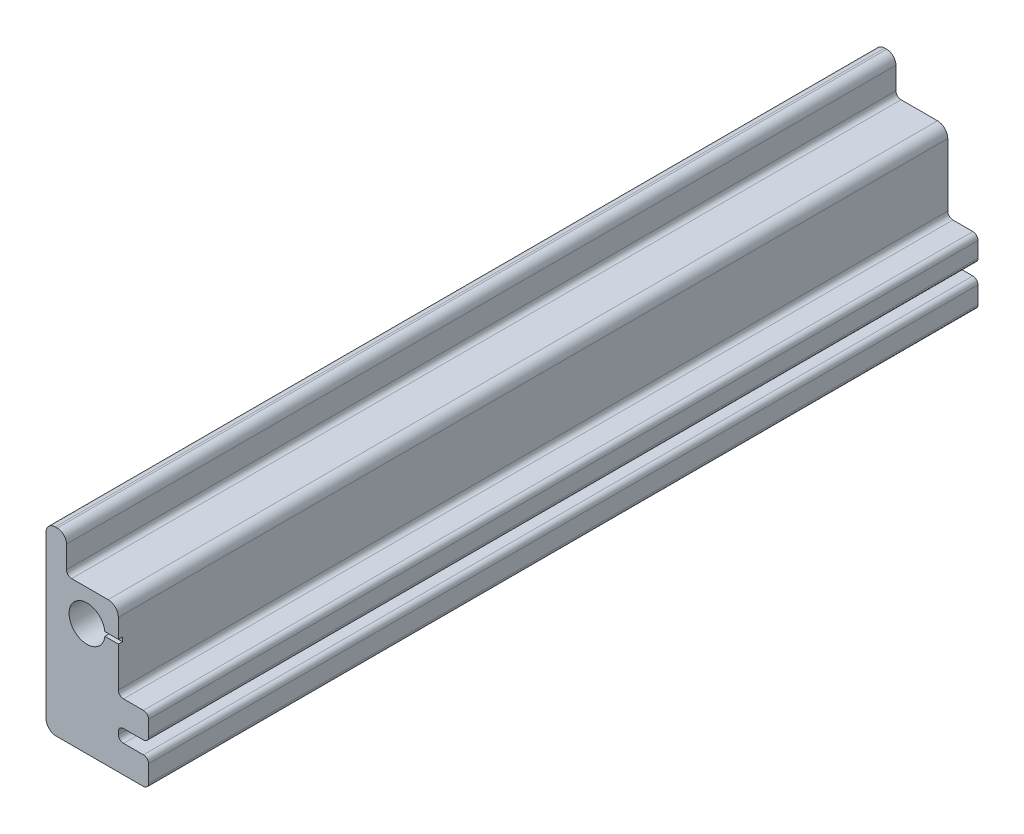
ISO-10303-21;
HEADER;
FILE_DESCRIPTION(('STEP AP214'),'2;1');
FILE_NAME('part.step','',(''),(''),'','','');
FILE_SCHEMA(('AUTOMOTIVE_DESIGN { 1 0 10303 214 1 1 1 1 }'));
ENDSEC;
DATA;
#1=APPLICATION_CONTEXT('core data for automotive mechanical design processes');
#2=APPLICATION_PROTOCOL_DEFINITION('international standard','automotive_design',2000,#1);
#3=PRODUCT_CONTEXT('',#1,'mechanical');
#4=PRODUCT('Part','Part','',(#3));
#5=PRODUCT_RELATED_PRODUCT_CATEGORY('part','',(#4));
#6=PRODUCT_DEFINITION_FORMATION('','',#4);
#7=PRODUCT_DEFINITION_CONTEXT('part definition',#1,'design');
#8=PRODUCT_DEFINITION('design','',#6,#7);
#9=PRODUCT_DEFINITION_SHAPE('','',#8);
#10=(LENGTH_UNIT() NAMED_UNIT(*) SI_UNIT(.MILLI.,.METRE.));
#11=(NAMED_UNIT(*) PLANE_ANGLE_UNIT() SI_UNIT($,.RADIAN.));
#12=(NAMED_UNIT(*) SI_UNIT($,.STERADIAN.) SOLID_ANGLE_UNIT());
#13=UNCERTAINTY_MEASURE_WITH_UNIT(LENGTH_MEASURE(1.E-05),#10,'distance_accuracy_value','');
#14=(GEOMETRIC_REPRESENTATION_CONTEXT(3) GLOBAL_UNCERTAINTY_ASSIGNED_CONTEXT((#13)) GLOBAL_UNIT_ASSIGNED_CONTEXT((#10,
#11,#12)) REPRESENTATION_CONTEXT('',''));
#15=CARTESIAN_POINT('',(0.,0.,0.));
#16=DIRECTION('',(0.,0.,1.));
#17=DIRECTION('',(1.,0.,0.));
#18=AXIS2_PLACEMENT_3D('',#15,#16,#17);
#19=CARTESIAN_POINT('',(22.56282,-48.097179904,513.461));
#20=DIRECTION('',(0.,0.,1.));
#21=DIRECTION('',(1.,0.,0.));
#22=AXIS2_PLACEMENT_3D('',#19,#20,#21);
#23=PLANE('',#22);
#24=DIRECTION('',(-1.,0.,0.));
#25=VECTOR('',#24,1.);
#26=CARTESIAN_POINT('',(-1.27,1.27,513.461));
#27=LINE('',#26,#25);
#28=CARTESIAN_POINT('',(19.38782,1.27,513.461));
#29=VERTEX_POINT('',#28);
#30=CARTESIAN_POINT('',(11.0396900432032,1.27,513.461));
#31=VERTEX_POINT('',#30);
#32=EDGE_CURVE('E440',#29,#31,#27,.T.);
#33=ORIENTED_EDGE('',*,*,#32,.F.);
#34=DIRECTION('',(0.,1.,0.));
#35=VECTOR('',#34,1.);
#36=CARTESIAN_POINT('',(19.38782,-25.872179904,513.461));
#37=LINE('',#36,#35);
#38=CARTESIAN_POINT('',(19.38782,13.03782,513.461));
#39=VERTEX_POINT('',#38);
#40=EDGE_CURVE('E475',#29,#39,#37,.T.);
#41=ORIENTED_EDGE('',*,*,#40,.T.);
#42=CARTESIAN_POINT('',(13.03782,13.03782,513.461));
#43=DIRECTION('',(0.,0.,1.));
#44=DIRECTION('',(1.,0.,0.));
#45=AXIS2_PLACEMENT_3D('',#42,#43,#44);
#46=CIRCLE('',#45,6.35);
#47=CARTESIAN_POINT('',(13.03782,19.38782,513.461));
#48=VERTEX_POINT('',#47);
#49=EDGE_CURVE('E478',#39,#48,#46,.T.);
#50=ORIENTED_EDGE('',*,*,#49,.T.);
#51=DIRECTION('',(-1.,0.,0.));
#52=VECTOR('',#51,1.);
#53=CARTESIAN_POINT('',(13.03782,19.38782,513.461));
#54=LINE('',#53,#52);
#55=CARTESIAN_POINT('',(-9.52499999999998,19.38782,513.461));
#56=VERTEX_POINT('',#55);
#57=EDGE_CURVE('E481',#48,#56,#54,.T.);
#58=ORIENTED_EDGE('',*,*,#57,.T.);
#59=CARTESIAN_POINT('',(-9.525,22.56282,513.461));
#60=DIRECTION('',(0.,0.,-1.));
#61=DIRECTION('',(-1.,0.,0.));
#62=AXIS2_PLACEMENT_3D('',#59,#60,#61);
#63=CIRCLE('',#62,3.175);
#64=CARTESIAN_POINT('',(-12.7,22.56282,513.461));
#65=VERTEX_POINT('',#64);
#66=EDGE_CURVE('E484',#56,#65,#63,.T.);
#67=ORIENTED_EDGE('',*,*,#66,.T.);
#68=DIRECTION('',(0.,1.,0.));
#69=VECTOR('',#68,1.);
#70=CARTESIAN_POINT('',(-12.7,22.56282,513.461));
#71=LINE('',#70,#69);
#72=CARTESIAN_POINT('',(-12.7,36.297819962,513.461));
#73=VERTEX_POINT('',#72);
#74=EDGE_CURVE('E487',#65,#73,#71,.T.);
#75=ORIENTED_EDGE('',*,*,#74,.T.);
#76=CARTESIAN_POINT('',(-18.415,36.297819962,513.461));
#77=DIRECTION('',(0.,0.,1.));
#78=DIRECTION('',(1.,0.,0.));
#79=AXIS2_PLACEMENT_3D('',#76,#77,#78);
#80=CIRCLE('',#79,5.715);
#81=CARTESIAN_POINT('',(-18.415,42.012819962,513.461));
#82=VERTEX_POINT('',#81);
#83=EDGE_CURVE('E490',#73,#82,#80,.T.);
#84=ORIENTED_EDGE('',*,*,#83,.T.);
#85=DIRECTION('',(-1.,0.,0.));
#86=VECTOR('',#85,1.);
#87=CARTESIAN_POINT('',(-18.415,42.012819962,513.461));
#88=LINE('',#87,#86);
#89=CARTESIAN_POINT('',(-19.6849999999999,42.012819962,513.461));
#90=VERTEX_POINT('',#89);
#91=EDGE_CURVE('E493',#82,#90,#88,.T.);
#92=ORIENTED_EDGE('',*,*,#91,.T.);
#93=CARTESIAN_POINT('',(-19.685,36.297819962,513.461));
#94=DIRECTION('',(0.,0.,1.));
#95=DIRECTION('',(1.,0.,0.));
#96=AXIS2_PLACEMENT_3D('',#93,#94,#95);
#97=CIRCLE('',#96,5.715);
#98=CARTESIAN_POINT('',(-25.4,36.297819962,513.461));
#99=VERTEX_POINT('',#98);
#100=EDGE_CURVE('E496',#90,#99,#97,.T.);
#101=ORIENTED_EDGE('',*,*,#100,.T.);
#102=DIRECTION('',(0.,-1.,0.));
#103=VECTOR('',#102,1.);
#104=CARTESIAN_POINT('',(-25.4,-63.5,513.461));
#105=LINE('',#104,#103);
#106=CARTESIAN_POINT('',(-25.4,-63.5,513.461));
#107=VERTEX_POINT('',#106);
#108=EDGE_CURVE('E499',#99,#107,#105,.T.);
#109=ORIENTED_EDGE('',*,*,#108,.T.);
#110=CARTESIAN_POINT('',(-19.05,-63.5,513.461));
#111=DIRECTION('',(0.,0.,1.));
#112=DIRECTION('',(-1.,0.,0.));
#113=AXIS2_PLACEMENT_3D('',#110,#111,#112);
#114=CIRCLE('',#113,6.35);
#115=CARTESIAN_POINT('',(-19.05,-69.85,513.461));
#116=VERTEX_POINT('',#115);
#117=EDGE_CURVE('E502',#107,#116,#114,.T.);
#118=ORIENTED_EDGE('',*,*,#117,.T.);
#119=DIRECTION('',(1.,0.,0.));
#120=VECTOR('',#119,1.);
#121=CARTESIAN_POINT('',(34.925,-69.85,513.461));
#122=LINE('',#121,#120);
#123=CARTESIAN_POINT('',(34.925,-69.85,513.461));
#124=VERTEX_POINT('',#123);
#125=EDGE_CURVE('E505',#116,#124,#122,.T.);
#126=ORIENTED_EDGE('',*,*,#125,.T.);
#127=CARTESIAN_POINT('',(34.925,-66.675,513.461));
#128=DIRECTION('',(0.,0.,1.));
#129=DIRECTION('',(1.,0.,0.));
#130=AXIS2_PLACEMENT_3D('',#127,#128,#129);
#131=CIRCLE('',#130,3.175);
#132=CARTESIAN_POINT('',(38.1,-66.675,513.461));
#133=VERTEX_POINT('',#132);
#134=EDGE_CURVE('E508',#124,#133,#131,.T.);
#135=ORIENTED_EDGE('',*,*,#134,.T.);
#136=DIRECTION('',(0.,1.,0.));
#137=VECTOR('',#136,1.);
#138=CARTESIAN_POINT('',(38.1,-66.675,513.461));
#139=LINE('',#138,#137);
#140=CARTESIAN_POINT('',(38.1000000000001,-56.034679904,513.461));
#141=VERTEX_POINT('',#140);
#142=EDGE_CURVE('E511',#133,#141,#139,.T.);
#143=ORIENTED_EDGE('',*,*,#142,.T.);
#144=CARTESIAN_POINT('',(34.9250000000001,-56.034679904,513.461));
#145=DIRECTION('',(0.,0.,1.));
#146=DIRECTION('',(-1.,0.,0.));
#147=AXIS2_PLACEMENT_3D('',#144,#145,#146);
#148=CIRCLE('',#147,3.17499999999999);
#149=CARTESIAN_POINT('',(34.9250000000001,-52.859679904,513.461));
#150=VERTEX_POINT('',#149);
#151=EDGE_CURVE('E229',#141,#150,#148,.T.);
#152=ORIENTED_EDGE('',*,*,#151,.T.);
#153=DIRECTION('',(-1.,0.,0.));
#154=VECTOR('',#153,1.);
#155=CARTESIAN_POINT('',(22.56282,-52.859679904,513.461));
#156=LINE('',#155,#154);
#157=CARTESIAN_POINT('',(22.56282,-52.859679904,513.461));
#158=VERTEX_POINT('',#157);
#159=EDGE_CURVE('E222',#150,#158,#156,.T.);
#160=ORIENTED_EDGE('',*,*,#159,.T.);
#161=CARTESIAN_POINT('',(22.56282,-49.684679904,513.461));
#162=DIRECTION('',(0.,0.,-1.));
#163=DIRECTION('',(-1.,0.,0.));
#164=AXIS2_PLACEMENT_3D('',#161,#162,#163);
#165=CIRCLE('',#164,3.175);
#166=CARTESIAN_POINT('',(19.38782,-49.684679904,513.461));
#167=VERTEX_POINT('',#166);
#168=EDGE_CURVE('E226',#158,#167,#165,.T.);
#169=ORIENTED_EDGE('',*,*,#168,.T.);
#170=DIRECTION('',(0.,1.,0.));
#171=VECTOR('',#170,1.);
#172=CARTESIAN_POINT('',(19.38782,-48.097179904,513.461));
#173=LINE('',#172,#171);
#174=CARTESIAN_POINT('',(19.38782,-48.097179904,513.461));
#175=VERTEX_POINT('',#174);
#176=EDGE_CURVE('E69',#167,#175,#173,.T.);
#177=ORIENTED_EDGE('',*,*,#176,.T.);
#178=CARTESIAN_POINT('',(22.56282,-48.097179904,513.461));
#179=DIRECTION('',(0.,0.,-1.));
#180=DIRECTION('',(1.,0.,0.));
#181=AXIS2_PLACEMENT_3D('',#178,#179,#180);
#182=CIRCLE('',#181,3.17500000000001);
#183=CARTESIAN_POINT('',(22.56282,-44.922179904,513.461));
#184=VERTEX_POINT('',#183);
#185=EDGE_CURVE('E326',#175,#184,#182,.T.);
#186=ORIENTED_EDGE('',*,*,#185,.T.);
#187=DIRECTION('',(1.,0.,0.));
#188=VECTOR('',#187,1.);
#189=CARTESIAN_POINT('',(34.9250000000001,-44.922179904,513.461));
#190=LINE('',#189,#188);
#191=CARTESIAN_POINT('',(34.9250000000001,-44.922179904,513.461));
#192=VERTEX_POINT('',#191);
#193=EDGE_CURVE('E159',#184,#192,#190,.T.);
#194=ORIENTED_EDGE('',*,*,#193,.T.);
#195=CARTESIAN_POINT('',(34.9250000000001,-41.747179904,513.461));
#196=DIRECTION('',(0.,0.,1.));
#197=DIRECTION('',(1.,0.,0.));
#198=AXIS2_PLACEMENT_3D('',#195,#196,#197);
#199=CIRCLE('',#198,3.17499999999999);
#200=CARTESIAN_POINT('',(38.1000000000001,-41.747179904,513.461));
#201=VERTEX_POINT('',#200);
#202=EDGE_CURVE('E460',#192,#201,#199,.T.);
#203=ORIENTED_EDGE('',*,*,#202,.T.);
#204=DIRECTION('',(0.,1.,0.));
#205=VECTOR('',#204,1.);
#206=CARTESIAN_POINT('',(38.1,-41.747179904,513.461));
#207=LINE('',#206,#205);
#208=CARTESIAN_POINT('',(38.1,-32.222179904,513.461));
#209=VERTEX_POINT('',#208);
#210=EDGE_CURVE('E463',#201,#209,#207,.T.);
#211=ORIENTED_EDGE('',*,*,#210,.T.);
#212=CARTESIAN_POINT('',(34.925,-32.222179904,513.461));
#213=DIRECTION('',(0.,0.,1.));
#214=DIRECTION('',(1.,0.,0.));
#215=AXIS2_PLACEMENT_3D('',#212,#213,#214);
#216=CIRCLE('',#215,3.175);
#217=CARTESIAN_POINT('',(34.925,-29.047179904,513.461));
#218=VERTEX_POINT('',#217);
#219=EDGE_CURVE('E466',#209,#218,#216,.T.);
#220=ORIENTED_EDGE('',*,*,#219,.T.);
#221=DIRECTION('',(-1.,0.,0.));
#222=VECTOR('',#221,1.);
#223=CARTESIAN_POINT('',(34.925,-29.047179904,513.461));
#224=LINE('',#223,#222);
#225=CARTESIAN_POINT('',(22.56282,-29.047179904,513.461));
#226=VERTEX_POINT('',#225);
#227=EDGE_CURVE('E469',#218,#226,#224,.T.);
#228=ORIENTED_EDGE('',*,*,#227,.T.);
#229=CARTESIAN_POINT('',(22.56282,-25.872179904,513.461));
#230=DIRECTION('',(0.,0.,-1.));
#231=DIRECTION('',(1.,0.,0.));
#232=AXIS2_PLACEMENT_3D('',#229,#230,#231);
#233=CIRCLE('',#232,3.17500000000001);
#234=CARTESIAN_POINT('',(19.38782,-25.872179904,513.461));
#235=VERTEX_POINT('',#234);
#236=EDGE_CURVE('E472',#226,#235,#233,.T.);
#237=ORIENTED_EDGE('',*,*,#236,.T.);
#238=CARTESIAN_POINT('',(19.38782,-1.27,513.461));
#239=VERTEX_POINT('',#238);
#240=EDGE_CURVE('E438',#235,#239,#37,.T.);
#241=ORIENTED_EDGE('',*,*,#240,.T.);
#242=DIRECTION('',(1.,0.,0.));
#243=VECTOR('',#242,1.);
#244=CARTESIAN_POINT('',(-1.27,-1.27,513.461));
#245=LINE('',#244,#243);
#246=CARTESIAN_POINT('',(11.0396900432032,-1.27,513.461));
#247=VERTEX_POINT('',#246);
#248=EDGE_CURVE('E426',#247,#239,#245,.T.);
#249=ORIENTED_EDGE('',*,*,#248,.F.);
#250=CARTESIAN_POINT('',(0.,0.,513.461));
#251=DIRECTION('',(0.,0.,1.));
#252=DIRECTION('',(1.,0.,0.));
#253=AXIS2_PLACEMENT_3D('',#250,#251,#252);
#254=CIRCLE('',#253,11.1125);
#255=EDGE_CURVE('E259',#31,#247,#254,.T.);
#256=ORIENTED_EDGE('',*,*,#255,.F.);
#257=EDGE_LOOP('',(#33,#41,#50,#58,#67,#75,#84,#92,#101,#109,#118,#126,#135,#143,#152,#160,#169,
#177,#186,#194,#203,#211,#220,#228,#237,#241,#249,#256));
#258=FACE_BOUND('',#257,.T.);
#259=ADVANCED_FACE('F45',(#258),#23,.T.);
#260=CARTESIAN_POINT('',(22.56282,-48.097179904,0.));
#261=DIRECTION('',(0.,0.,1.));
#262=DIRECTION('',(1.,0.,0.));
#263=AXIS2_PLACEMENT_3D('',#260,#261,#262);
#264=PLANE('',#263);
#265=CARTESIAN_POINT('',(22.56282,-48.097179904,0.));
#266=DIRECTION('',(0.,0.,-1.));
#267=DIRECTION('',(1.,0.,0.));
#268=AXIS2_PLACEMENT_3D('',#265,#266,#267);
#269=CIRCLE('',#268,3.17500000000001);
#270=CARTESIAN_POINT('',(19.38782,-48.097179904,0.));
#271=VERTEX_POINT('',#270);
#272=CARTESIAN_POINT('',(22.56282,-44.922179904,0.));
#273=VERTEX_POINT('',#272);
#274=EDGE_CURVE('E254',#271,#273,#269,.T.);
#275=ORIENTED_EDGE('',*,*,#274,.F.);
#276=DIRECTION('',(0.,1.,0.));
#277=VECTOR('',#276,1.);
#278=CARTESIAN_POINT('',(19.38782,-48.097179904,0.));
#279=LINE('',#278,#277);
#280=CARTESIAN_POINT('',(19.38782,-49.684679904,0.));
#281=VERTEX_POINT('',#280);
#282=EDGE_CURVE('E150',#281,#271,#279,.T.);
#283=ORIENTED_EDGE('',*,*,#282,.F.);
#284=CARTESIAN_POINT('',(22.56282,-49.684679904,0.));
#285=DIRECTION('',(0.,0.,-1.));
#286=DIRECTION('',(-1.,0.,0.));
#287=AXIS2_PLACEMENT_3D('',#284,#285,#286);
#288=CIRCLE('',#287,3.175);
#289=CARTESIAN_POINT('',(22.56282,-52.859679904,0.));
#290=VERTEX_POINT('',#289);
#291=EDGE_CURVE('E321',#290,#281,#288,.T.);
#292=ORIENTED_EDGE('',*,*,#291,.F.);
#293=DIRECTION('',(-1.,0.,0.));
#294=VECTOR('',#293,1.);
#295=CARTESIAN_POINT('',(22.56282,-52.859679904,0.));
#296=LINE('',#295,#294);
#297=CARTESIAN_POINT('',(34.9250000000001,-52.859679904,0.));
#298=VERTEX_POINT('',#297);
#299=EDGE_CURVE('E239',#298,#290,#296,.T.);
#300=ORIENTED_EDGE('',*,*,#299,.F.);
#301=CARTESIAN_POINT('',(34.9250000000001,-56.034679904,0.));
#302=DIRECTION('',(0.,0.,1.));
#303=DIRECTION('',(-1.,0.,0.));
#304=AXIS2_PLACEMENT_3D('',#301,#302,#303);
#305=CIRCLE('',#304,3.17499999999999);
#306=CARTESIAN_POINT('',(38.1000000000001,-56.034679904,0.));
#307=VERTEX_POINT('',#306);
#308=EDGE_CURVE('E316',#307,#298,#305,.T.);
#309=ORIENTED_EDGE('',*,*,#308,.F.);
#310=DIRECTION('',(0.,1.,0.));
#311=VECTOR('',#310,1.);
#312=CARTESIAN_POINT('',(38.1,-66.675,0.));
#313=LINE('',#312,#311);
#314=CARTESIAN_POINT('',(38.1,-66.675,0.));
#315=VERTEX_POINT('',#314);
#316=EDGE_CURVE('E313',#315,#307,#313,.T.);
#317=ORIENTED_EDGE('',*,*,#316,.F.);
#318=CARTESIAN_POINT('',(34.925,-66.675,0.));
#319=DIRECTION('',(0.,0.,1.));
#320=DIRECTION('',(1.,0.,0.));
#321=AXIS2_PLACEMENT_3D('',#318,#319,#320);
#322=CIRCLE('',#321,3.175);
#323=CARTESIAN_POINT('',(34.925,-69.85,0.));
#324=VERTEX_POINT('',#323);
#325=EDGE_CURVE('E310',#324,#315,#322,.T.);
#326=ORIENTED_EDGE('',*,*,#325,.F.);
#327=DIRECTION('',(1.,0.,0.));
#328=VECTOR('',#327,1.);
#329=CARTESIAN_POINT('',(34.925,-69.85,0.));
#330=LINE('',#329,#328);
#331=CARTESIAN_POINT('',(-19.05,-69.85,0.));
#332=VERTEX_POINT('',#331);
#333=EDGE_CURVE('E307',#332,#324,#330,.T.);
#334=ORIENTED_EDGE('',*,*,#333,.F.);
#335=CARTESIAN_POINT('',(-19.05,-63.5,0.));
#336=DIRECTION('',(0.,0.,1.));
#337=DIRECTION('',(-1.,0.,0.));
#338=AXIS2_PLACEMENT_3D('',#335,#336,#337);
#339=CIRCLE('',#338,6.35);
#340=CARTESIAN_POINT('',(-25.4,-63.5,0.));
#341=VERTEX_POINT('',#340);
#342=EDGE_CURVE('E304',#341,#332,#339,.T.);
#343=ORIENTED_EDGE('',*,*,#342,.F.);
#344=DIRECTION('',(0.,-1.,0.));
#345=VECTOR('',#344,1.);
#346=CARTESIAN_POINT('',(-25.4,-63.5,0.));
#347=LINE('',#346,#345);
#348=CARTESIAN_POINT('',(-25.4,36.297819962,0.));
#349=VERTEX_POINT('',#348);
#350=EDGE_CURVE('E301',#349,#341,#347,.T.);
#351=ORIENTED_EDGE('',*,*,#350,.F.);
#352=CARTESIAN_POINT('',(-19.685,36.297819962,0.));
#353=DIRECTION('',(0.,0.,1.));
#354=DIRECTION('',(1.,0.,0.));
#355=AXIS2_PLACEMENT_3D('',#352,#353,#354);
#356=CIRCLE('',#355,5.715);
#357=CARTESIAN_POINT('',(-19.6849999999999,42.012819962,0.));
#358=VERTEX_POINT('',#357);
#359=EDGE_CURVE('E298',#358,#349,#356,.T.);
#360=ORIENTED_EDGE('',*,*,#359,.F.);
#361=DIRECTION('',(-1.,0.,0.));
#362=VECTOR('',#361,1.);
#363=CARTESIAN_POINT('',(-18.415,42.012819962,0.));
#364=LINE('',#363,#362);
#365=CARTESIAN_POINT('',(-18.415,42.012819962,0.));
#366=VERTEX_POINT('',#365);
#367=EDGE_CURVE('E295',#366,#358,#364,.T.);
#368=ORIENTED_EDGE('',*,*,#367,.F.);
#369=CARTESIAN_POINT('',(-18.415,36.297819962,0.));
#370=DIRECTION('',(0.,0.,1.));
#371=DIRECTION('',(1.,0.,0.));
#372=AXIS2_PLACEMENT_3D('',#369,#370,#371);
#373=CIRCLE('',#372,5.715);
#374=CARTESIAN_POINT('',(-12.7,36.297819962,0.));
#375=VERTEX_POINT('',#374);
#376=EDGE_CURVE('E292',#375,#366,#373,.T.);
#377=ORIENTED_EDGE('',*,*,#376,.F.);
#378=DIRECTION('',(0.,1.,0.));
#379=VECTOR('',#378,1.);
#380=CARTESIAN_POINT('',(-12.7,22.56282,0.));
#381=LINE('',#380,#379);
#382=CARTESIAN_POINT('',(-12.7,22.56282,0.));
#383=VERTEX_POINT('',#382);
#384=EDGE_CURVE('E289',#383,#375,#381,.T.);
#385=ORIENTED_EDGE('',*,*,#384,.F.);
#386=CARTESIAN_POINT('',(-9.525,22.56282,0.));
#387=DIRECTION('',(0.,0.,-1.));
#388=DIRECTION('',(-1.,0.,0.));
#389=AXIS2_PLACEMENT_3D('',#386,#387,#388);
#390=CIRCLE('',#389,3.175);
#391=CARTESIAN_POINT('',(-9.52499999999998,19.38782,0.));
#392=VERTEX_POINT('',#391);
#393=EDGE_CURVE('E286',#392,#383,#390,.T.);
#394=ORIENTED_EDGE('',*,*,#393,.F.);
#395=DIRECTION('',(-1.,0.,0.));
#396=VECTOR('',#395,1.);
#397=CARTESIAN_POINT('',(13.03782,19.38782,0.));
#398=LINE('',#397,#396);
#399=CARTESIAN_POINT('',(13.03782,19.38782,0.));
#400=VERTEX_POINT('',#399);
#401=EDGE_CURVE('E283',#400,#392,#398,.T.);
#402=ORIENTED_EDGE('',*,*,#401,.F.);
#403=CARTESIAN_POINT('',(13.03782,13.03782,0.));
#404=DIRECTION('',(0.,0.,1.));
#405=DIRECTION('',(1.,0.,0.));
#406=AXIS2_PLACEMENT_3D('',#403,#404,#405);
#407=CIRCLE('',#406,6.35);
#408=CARTESIAN_POINT('',(19.38782,13.03782,0.));
#409=VERTEX_POINT('',#408);
#410=EDGE_CURVE('E280',#409,#400,#407,.T.);
#411=ORIENTED_EDGE('',*,*,#410,.F.);
#412=DIRECTION('',(0.,1.,0.));
#413=VECTOR('',#412,1.);
#414=CARTESIAN_POINT('',(19.38782,-25.872179904,0.));
#415=LINE('',#414,#413);
#416=CARTESIAN_POINT('',(19.38782,-25.872179904,0.));
#417=VERTEX_POINT('',#416);
#418=EDGE_CURVE('E277',#417,#409,#415,.T.);
#419=ORIENTED_EDGE('',*,*,#418,.F.);
#420=CARTESIAN_POINT('',(22.56282,-25.872179904,0.));
#421=DIRECTION('',(0.,0.,-1.));
#422=DIRECTION('',(1.,0.,0.));
#423=AXIS2_PLACEMENT_3D('',#420,#421,#422);
#424=CIRCLE('',#423,3.17500000000001);
#425=CARTESIAN_POINT('',(22.56282,-29.047179904,0.));
#426=VERTEX_POINT('',#425);
#427=EDGE_CURVE('E274',#426,#417,#424,.T.);
#428=ORIENTED_EDGE('',*,*,#427,.F.);
#429=DIRECTION('',(-1.,0.,0.));
#430=VECTOR('',#429,1.);
#431=CARTESIAN_POINT('',(34.925,-29.047179904,0.));
#432=LINE('',#431,#430);
#433=CARTESIAN_POINT('',(34.925,-29.047179904,0.));
#434=VERTEX_POINT('',#433);
#435=EDGE_CURVE('E271',#434,#426,#432,.T.);
#436=ORIENTED_EDGE('',*,*,#435,.F.);
#437=CARTESIAN_POINT('',(34.925,-32.222179904,0.));
#438=DIRECTION('',(0.,0.,1.));
#439=DIRECTION('',(1.,0.,0.));
#440=AXIS2_PLACEMENT_3D('',#437,#438,#439);
#441=CIRCLE('',#440,3.175);
#442=CARTESIAN_POINT('',(38.1,-32.222179904,0.));
#443=VERTEX_POINT('',#442);
#444=EDGE_CURVE('E268',#443,#434,#441,.T.);
#445=ORIENTED_EDGE('',*,*,#444,.F.);
#446=DIRECTION('',(0.,1.,0.));
#447=VECTOR('',#446,1.);
#448=CARTESIAN_POINT('',(38.1,-41.747179904,0.));
#449=LINE('',#448,#447);
#450=CARTESIAN_POINT('',(38.1000000000001,-41.747179904,0.));
#451=VERTEX_POINT('',#450);
#452=EDGE_CURVE('E265',#451,#443,#449,.T.);
#453=ORIENTED_EDGE('',*,*,#452,.F.);
#454=CARTESIAN_POINT('',(34.9250000000001,-41.747179904,0.));
#455=DIRECTION('',(0.,0.,1.));
#456=DIRECTION('',(1.,0.,0.));
#457=AXIS2_PLACEMENT_3D('',#454,#455,#456);
#458=CIRCLE('',#457,3.17499999999999);
#459=CARTESIAN_POINT('',(34.9250000000001,-44.922179904,0.));
#460=VERTEX_POINT('',#459);
#461=EDGE_CURVE('E262',#460,#451,#458,.T.);
#462=ORIENTED_EDGE('',*,*,#461,.F.);
#463=DIRECTION('',(1.,0.,0.));
#464=VECTOR('',#463,1.);
#465=CARTESIAN_POINT('',(34.9250000000001,-44.922179904,0.));
#466=LINE('',#465,#464);
#467=EDGE_CURVE('E258',#273,#460,#466,.T.);
#468=ORIENTED_EDGE('',*,*,#467,.F.);
#469=EDGE_LOOP('',(#275,#283,#292,#300,#309,#317,#326,#334,#343,#351,#360,#368,#377,#385,#394,
#402,#411,#419,#428,#436,#445,#453,#462,#468));
#470=FACE_BOUND('',#469,.T.);
#471=CARTESIAN_POINT('',(0.,0.,0.));
#472=DIRECTION('',(0.,0.,1.));
#473=DIRECTION('',(1.,0.,0.));
#474=AXIS2_PLACEMENT_3D('',#471,#472,#473);
#475=CIRCLE('',#474,11.1125);
#476=CARTESIAN_POINT('',(11.1125,0.,0.));
#477=VERTEX_POINT('',#476);
#478=EDGE_CURVE('E446',#477,#477,#475,.T.);
#479=ORIENTED_EDGE('',*,*,#478,.T.);
#480=EDGE_LOOP('',(#479));
#481=FACE_BOUND('',#480,.T.);
#482=ADVANCED_FACE('F588',(#470,#481),#264,.F.);
#483=CARTESIAN_POINT('',(22.56282,-48.097179904,513.461));
#484=DIRECTION('',(0.,0.,-1.));
#485=DIRECTION('',(-1.,0.,0.));
#486=AXIS2_PLACEMENT_3D('',#483,#484,#485);
#487=CYLINDRICAL_SURFACE('',#486,3.17500000000001);
#488=ORIENTED_EDGE('',*,*,#274,.T.);
#489=DIRECTION('',(0.,0.,-1.));
#490=VECTOR('',#489,1.);
#491=CARTESIAN_POINT('',(22.56282,-44.922179904,513.461));
#492=LINE('',#491,#490);
#493=EDGE_CURVE('E409',#184,#273,#492,.T.);
#494=ORIENTED_EDGE('',*,*,#493,.F.);
#495=ORIENTED_EDGE('',*,*,#185,.F.);
#496=DIRECTION('',(0.,0.,-1.));
#497=VECTOR('',#496,1.);
#498=CARTESIAN_POINT('',(19.38782,-48.097179904,513.461));
#499=LINE('',#498,#497);
#500=EDGE_CURVE('E250',#175,#271,#499,.T.);
#501=ORIENTED_EDGE('',*,*,#500,.T.);
#502=EDGE_LOOP('',(#488,#494,#495,#501));
#503=FACE_BOUND('',#502,.T.);
#504=ADVANCED_FACE('F47',(#503),#487,.F.);
#505=CARTESIAN_POINT('',(34.9250000000001,-44.922179904,513.461));
#506=DIRECTION('',(0.,1.,0.));
#507=DIRECTION('',(-1.,0.,0.));
#508=AXIS2_PLACEMENT_3D('',#505,#506,#507);
#509=PLANE('',#508);
#510=ORIENTED_EDGE('',*,*,#467,.T.);
#511=DIRECTION('',(0.,0.,-1.));
#512=VECTOR('',#511,1.);
#513=CARTESIAN_POINT('',(34.9250000000001,-44.922179904,513.461));
#514=LINE('',#513,#512);
#515=EDGE_CURVE('E405',#192,#460,#514,.T.);
#516=ORIENTED_EDGE('',*,*,#515,.F.);
#517=ORIENTED_EDGE('',*,*,#193,.F.);
#518=ORIENTED_EDGE('',*,*,#493,.T.);
#519=EDGE_LOOP('',(#510,#516,#517,#518));
#520=FACE_BOUND('',#519,.T.);
#521=ADVANCED_FACE('F596',(#520),#509,.F.);
#522=CARTESIAN_POINT('',(34.9250000000001,-41.747179904,513.461));
#523=DIRECTION('',(0.,0.,-1.));
#524=DIRECTION('',(-1.,0.,0.));
#525=AXIS2_PLACEMENT_3D('',#522,#523,#524);
#526=CYLINDRICAL_SURFACE('',#525,3.17499999999999);
#527=ORIENTED_EDGE('',*,*,#461,.T.);
#528=DIRECTION('',(0.,0.,-1.));
#529=VECTOR('',#528,1.);
#530=CARTESIAN_POINT('',(38.1000000000001,-41.747179904,513.461));
#531=LINE('',#530,#529);
#532=EDGE_CURVE('E401',#201,#451,#531,.T.);
#533=ORIENTED_EDGE('',*,*,#532,.F.);
#534=ORIENTED_EDGE('',*,*,#202,.F.);
#535=ORIENTED_EDGE('',*,*,#515,.T.);
#536=EDGE_LOOP('',(#527,#533,#534,#535));
#537=FACE_BOUND('',#536,.T.);
#538=ADVANCED_FACE('F599',(#537),#526,.T.);
#539=CARTESIAN_POINT('',(38.1,-41.747179904,513.461));
#540=DIRECTION('',(-1.,0.,0.));
#541=DIRECTION('',(0.,-1.,0.));
#542=AXIS2_PLACEMENT_3D('',#539,#540,#541);
#543=PLANE('',#542);
#544=ORIENTED_EDGE('',*,*,#452,.T.);
#545=DIRECTION('',(0.,0.,-1.));
#546=VECTOR('',#545,1.);
#547=CARTESIAN_POINT('',(38.1,-32.222179904,513.461));
#548=LINE('',#547,#546);
#549=EDGE_CURVE('E397',#209,#443,#548,.T.);
#550=ORIENTED_EDGE('',*,*,#549,.F.);
#551=ORIENTED_EDGE('',*,*,#210,.F.);
#552=ORIENTED_EDGE('',*,*,#532,.T.);
#553=EDGE_LOOP('',(#544,#550,#551,#552));
#554=FACE_BOUND('',#553,.T.);
#555=ADVANCED_FACE('F604',(#554),#543,.F.);
#556=CARTESIAN_POINT('',(34.925,-32.222179904,513.461));
#557=DIRECTION('',(0.,0.,-1.));
#558=DIRECTION('',(-1.,0.,0.));
#559=AXIS2_PLACEMENT_3D('',#556,#557,#558);
#560=CYLINDRICAL_SURFACE('',#559,3.175);
#561=ORIENTED_EDGE('',*,*,#444,.T.);
#562=DIRECTION('',(0.,0.,-1.));
#563=VECTOR('',#562,1.);
#564=CARTESIAN_POINT('',(34.925,-29.047179904,513.461));
#565=LINE('',#564,#563);
#566=EDGE_CURVE('E393',#218,#434,#565,.T.);
#567=ORIENTED_EDGE('',*,*,#566,.F.);
#568=ORIENTED_EDGE('',*,*,#219,.F.);
#569=ORIENTED_EDGE('',*,*,#549,.T.);
#570=EDGE_LOOP('',(#561,#567,#568,#569));
#571=FACE_BOUND('',#570,.T.);
#572=ADVANCED_FACE('F610',(#571),#560,.T.);
#573=CARTESIAN_POINT('',(34.925,-29.047179904,513.461));
#574=DIRECTION('',(0.,-1.,0.));
#575=DIRECTION('',(0.,0.,-1.));
#576=AXIS2_PLACEMENT_3D('',#573,#574,#575);
#577=PLANE('',#576);
#578=ORIENTED_EDGE('',*,*,#435,.T.);
#579=DIRECTION('',(0.,0.,-1.));
#580=VECTOR('',#579,1.);
#581=CARTESIAN_POINT('',(22.56282,-29.047179904,513.461));
#582=LINE('',#581,#580);
#583=EDGE_CURVE('E389',#226,#426,#582,.T.);
#584=ORIENTED_EDGE('',*,*,#583,.F.);
#585=ORIENTED_EDGE('',*,*,#227,.F.);
#586=ORIENTED_EDGE('',*,*,#566,.T.);
#587=EDGE_LOOP('',(#578,#584,#585,#586));
#588=FACE_BOUND('',#587,.T.);
#589=ADVANCED_FACE('F614',(#588),#577,.F.);
#590=CARTESIAN_POINT('',(22.56282,-25.872179904,513.461));
#591=DIRECTION('',(0.,0.,-1.));
#592=DIRECTION('',(-1.,0.,0.));
#593=AXIS2_PLACEMENT_3D('',#590,#591,#592);
#594=CYLINDRICAL_SURFACE('',#593,3.17500000000001);
#595=ORIENTED_EDGE('',*,*,#427,.T.);
#596=DIRECTION('',(0.,0.,-1.));
#597=VECTOR('',#596,1.);
#598=CARTESIAN_POINT('',(19.38782,-25.872179904,513.461));
#599=LINE('',#598,#597);
#600=EDGE_CURVE('E385',#235,#417,#599,.T.);
#601=ORIENTED_EDGE('',*,*,#600,.F.);
#602=ORIENTED_EDGE('',*,*,#236,.F.);
#603=ORIENTED_EDGE('',*,*,#583,.T.);
#604=EDGE_LOOP('',(#595,#601,#602,#603));
#605=FACE_BOUND('',#604,.T.);
#606=ADVANCED_FACE('F619',(#605),#594,.F.);
#607=CARTESIAN_POINT('',(19.38782,-25.872179904,513.461));
#608=DIRECTION('',(-1.,0.,0.));
#609=DIRECTION('',(0.,0.,1.));
#610=AXIS2_PLACEMENT_3D('',#607,#608,#609);
#611=PLANE('',#610);
#612=ORIENTED_EDGE('',*,*,#40,.F.);
#613=DIRECTION('',(0.,0.,1.));
#614=VECTOR('',#613,1.);
#615=CARTESIAN_POINT('',(19.38782,1.27,510.921));
#616=LINE('',#615,#614);
#617=CARTESIAN_POINT('',(19.38782,1.27,510.921));
#618=VERTEX_POINT('',#617);
#619=EDGE_CURVE('E450',#618,#29,#616,.T.);
#620=ORIENTED_EDGE('',*,*,#619,.F.);
#621=DIRECTION('',(0.,1.,0.));
#622=VECTOR('',#621,1.);
#623=CARTESIAN_POINT('',(19.38782,1.27,510.921));
#624=LINE('',#623,#622);
#625=CARTESIAN_POINT('',(19.38782,-1.27,510.921));
#626=VERTEX_POINT('',#625);
#627=EDGE_CURVE('E622',#626,#618,#624,.T.);
#628=ORIENTED_EDGE('',*,*,#627,.F.);
#629=DIRECTION('',(0.,0.,1.));
#630=VECTOR('',#629,1.);
#631=CARTESIAN_POINT('',(19.38782,-1.27,510.921));
#632=LINE('',#631,#630);
#633=EDGE_CURVE('E453',#626,#239,#632,.T.);
#634=ORIENTED_EDGE('',*,*,#633,.T.);
#635=ORIENTED_EDGE('',*,*,#240,.F.);
#636=ORIENTED_EDGE('',*,*,#600,.T.);
#637=ORIENTED_EDGE('',*,*,#418,.T.);
#638=DIRECTION('',(0.,0.,-1.));
#639=VECTOR('',#638,1.);
#640=CARTESIAN_POINT('',(19.38782,13.03782,513.461));
#641=LINE('',#640,#639);
#642=EDGE_CURVE('E381',#39,#409,#641,.T.);
#643=ORIENTED_EDGE('',*,*,#642,.F.);
#644=EDGE_LOOP('',(#612,#620,#628,#634,#635,#636,#637,#643));
#645=FACE_BOUND('',#644,.T.);
#646=ADVANCED_FACE('F523',(#645),#611,.F.);
#647=CARTESIAN_POINT('',(13.03782,13.03782,513.461));
#648=DIRECTION('',(0.,0.,-1.));
#649=DIRECTION('',(-1.,0.,0.));
#650=AXIS2_PLACEMENT_3D('',#647,#648,#649);
#651=CYLINDRICAL_SURFACE('',#650,6.35);
#652=ORIENTED_EDGE('',*,*,#410,.T.);
#653=DIRECTION('',(0.,0.,-1.));
#654=VECTOR('',#653,1.);
#655=CARTESIAN_POINT('',(13.03782,19.38782,513.461));
#656=LINE('',#655,#654);
#657=EDGE_CURVE('E377',#48,#400,#656,.T.);
#658=ORIENTED_EDGE('',*,*,#657,.F.);
#659=ORIENTED_EDGE('',*,*,#49,.F.);
#660=ORIENTED_EDGE('',*,*,#642,.T.);
#661=EDGE_LOOP('',(#652,#658,#659,#660));
#662=FACE_BOUND('',#661,.T.);
#663=ADVANCED_FACE('F527',(#662),#651,.T.);
#664=CARTESIAN_POINT('',(13.03782,19.38782,513.461));
#665=DIRECTION('',(0.,-1.,0.));
#666=DIRECTION('',(0.,0.,-1.));
#667=AXIS2_PLACEMENT_3D('',#664,#665,#666);
#668=PLANE('',#667);
#669=ORIENTED_EDGE('',*,*,#401,.T.);
#670=DIRECTION('',(0.,0.,-1.));
#671=VECTOR('',#670,1.);
#672=CARTESIAN_POINT('',(-9.52499999999998,19.38782,513.461));
#673=LINE('',#672,#671);
#674=EDGE_CURVE('E373',#56,#392,#673,.T.);
#675=ORIENTED_EDGE('',*,*,#674,.F.);
#676=ORIENTED_EDGE('',*,*,#57,.F.);
#677=ORIENTED_EDGE('',*,*,#657,.T.);
#678=EDGE_LOOP('',(#669,#675,#676,#677));
#679=FACE_BOUND('',#678,.T.);
#680=ADVANCED_FACE('F532',(#679),#668,.F.);
#681=CARTESIAN_POINT('',(-9.525,22.56282,513.461));
#682=DIRECTION('',(0.,0.,-1.));
#683=DIRECTION('',(-1.,0.,0.));
#684=AXIS2_PLACEMENT_3D('',#681,#682,#683);
#685=CYLINDRICAL_SURFACE('',#684,3.175);
#686=ORIENTED_EDGE('',*,*,#393,.T.);
#687=DIRECTION('',(0.,0.,-1.));
#688=VECTOR('',#687,1.);
#689=CARTESIAN_POINT('',(-12.7,22.56282,513.461));
#690=LINE('',#689,#688);
#691=EDGE_CURVE('E369',#65,#383,#690,.T.);
#692=ORIENTED_EDGE('',*,*,#691,.F.);
#693=ORIENTED_EDGE('',*,*,#66,.F.);
#694=ORIENTED_EDGE('',*,*,#674,.T.);
#695=EDGE_LOOP('',(#686,#692,#693,#694));
#696=FACE_BOUND('',#695,.T.);
#697=ADVANCED_FACE('F538',(#696),#685,.F.);
#698=CARTESIAN_POINT('',(-12.7,22.56282,513.461));
#699=DIRECTION('',(-1.,0.,0.));
#700=DIRECTION('',(0.,0.,1.));
#701=AXIS2_PLACEMENT_3D('',#698,#699,#700);
#702=PLANE('',#701);
#703=ORIENTED_EDGE('',*,*,#384,.T.);
#704=DIRECTION('',(0.,0.,-1.));
#705=VECTOR('',#704,1.);
#706=CARTESIAN_POINT('',(-12.7,36.297819962,513.461));
#707=LINE('',#706,#705);
#708=EDGE_CURVE('E365',#73,#375,#707,.T.);
#709=ORIENTED_EDGE('',*,*,#708,.F.);
#710=ORIENTED_EDGE('',*,*,#74,.F.);
#711=ORIENTED_EDGE('',*,*,#691,.T.);
#712=EDGE_LOOP('',(#703,#709,#710,#711));
#713=FACE_BOUND('',#712,.T.);
#714=ADVANCED_FACE('F542',(#713),#702,.F.);
#715=CARTESIAN_POINT('',(-18.415,36.297819962,513.461));
#716=DIRECTION('',(0.,0.,-1.));
#717=DIRECTION('',(-1.,0.,0.));
#718=AXIS2_PLACEMENT_3D('',#715,#716,#717);
#719=CYLINDRICAL_SURFACE('',#718,5.715);
#720=ORIENTED_EDGE('',*,*,#376,.T.);
#721=DIRECTION('',(0.,0.,-1.));
#722=VECTOR('',#721,1.);
#723=CARTESIAN_POINT('',(-18.415,42.012819962,513.461));
#724=LINE('',#723,#722);
#725=EDGE_CURVE('E361',#82,#366,#724,.T.);
#726=ORIENTED_EDGE('',*,*,#725,.F.);
#727=ORIENTED_EDGE('',*,*,#83,.F.);
#728=ORIENTED_EDGE('',*,*,#708,.T.);
#729=EDGE_LOOP('',(#720,#726,#727,#728));
#730=FACE_BOUND('',#729,.T.);
#731=ADVANCED_FACE('F547',(#730),#719,.T.);
#732=CARTESIAN_POINT('',(-18.415,42.012819962,513.461));
#733=DIRECTION('',(0.,-1.,0.));
#734=DIRECTION('',(0.,0.,-1.));
#735=AXIS2_PLACEMENT_3D('',#732,#733,#734);
#736=PLANE('',#735);
#737=ORIENTED_EDGE('',*,*,#367,.T.);
#738=DIRECTION('',(0.,0.,-1.));
#739=VECTOR('',#738,1.);
#740=CARTESIAN_POINT('',(-19.6849999999999,42.012819962,513.461));
#741=LINE('',#740,#739);
#742=EDGE_CURVE('E357',#90,#358,#741,.T.);
#743=ORIENTED_EDGE('',*,*,#742,.F.);
#744=ORIENTED_EDGE('',*,*,#91,.F.);
#745=ORIENTED_EDGE('',*,*,#725,.T.);
#746=EDGE_LOOP('',(#737,#743,#744,#745));
#747=FACE_BOUND('',#746,.T.);
#748=ADVANCED_FACE('F553',(#747),#736,.F.);
#749=CARTESIAN_POINT('',(-19.685,36.297819962,513.461));
#750=DIRECTION('',(0.,0.,-1.));
#751=DIRECTION('',(-1.,0.,0.));
#752=AXIS2_PLACEMENT_3D('',#749,#750,#751);
#753=CYLINDRICAL_SURFACE('',#752,5.715);
#754=ORIENTED_EDGE('',*,*,#359,.T.);
#755=DIRECTION('',(0.,0.,-1.));
#756=VECTOR('',#755,1.);
#757=CARTESIAN_POINT('',(-25.4,36.297819962,513.461));
#758=LINE('',#757,#756);
#759=EDGE_CURVE('E353',#99,#349,#758,.T.);
#760=ORIENTED_EDGE('',*,*,#759,.F.);
#761=ORIENTED_EDGE('',*,*,#100,.F.);
#762=ORIENTED_EDGE('',*,*,#742,.T.);
#763=EDGE_LOOP('',(#754,#760,#761,#762));
#764=FACE_BOUND('',#763,.T.);
#765=ADVANCED_FACE('F557',(#764),#753,.T.);
#766=CARTESIAN_POINT('',(-25.4,-63.5,513.461));
#767=DIRECTION('',(1.,0.,0.));
#768=DIRECTION('',(0.,0.,-1.));
#769=AXIS2_PLACEMENT_3D('',#766,#767,#768);
#770=PLANE('',#769);
#771=ORIENTED_EDGE('',*,*,#350,.T.);
#772=DIRECTION('',(0.,0.,-1.));
#773=VECTOR('',#772,1.);
#774=CARTESIAN_POINT('',(-25.4,-63.5,513.461));
#775=LINE('',#774,#773);
#776=EDGE_CURVE('E349',#107,#341,#775,.T.);
#777=ORIENTED_EDGE('',*,*,#776,.F.);
#778=ORIENTED_EDGE('',*,*,#108,.F.);
#779=ORIENTED_EDGE('',*,*,#759,.T.);
#780=EDGE_LOOP('',(#771,#777,#778,#779));
#781=FACE_BOUND('',#780,.T.);
#782=ADVANCED_FACE('F562',(#781),#770,.F.);
#783=CARTESIAN_POINT('',(-19.05,-63.5,513.461));
#784=DIRECTION('',(0.,0.,-1.));
#785=DIRECTION('',(-1.,0.,0.));
#786=AXIS2_PLACEMENT_3D('',#783,#784,#785);
#787=CYLINDRICAL_SURFACE('',#786,6.35);
#788=ORIENTED_EDGE('',*,*,#342,.T.);
#789=DIRECTION('',(0.,0.,-1.));
#790=VECTOR('',#789,1.);
#791=CARTESIAN_POINT('',(-19.05,-69.85,513.461));
#792=LINE('',#791,#790);
#793=EDGE_CURVE('E345',#116,#332,#792,.T.);
#794=ORIENTED_EDGE('',*,*,#793,.F.);
#795=ORIENTED_EDGE('',*,*,#117,.F.);
#796=ORIENTED_EDGE('',*,*,#776,.T.);
#797=EDGE_LOOP('',(#788,#794,#795,#796));
#798=FACE_BOUND('',#797,.T.);
#799=ADVANCED_FACE('F568',(#798),#787,.T.);
#800=CARTESIAN_POINT('',(34.925,-69.85,513.461));
#801=DIRECTION('',(0.,1.,0.));
#802=DIRECTION('',(0.,0.,1.));
#803=AXIS2_PLACEMENT_3D('',#800,#801,#802);
#804=PLANE('',#803);
#805=ORIENTED_EDGE('',*,*,#333,.T.);
#806=DIRECTION('',(0.,0.,-1.));
#807=VECTOR('',#806,1.);
#808=CARTESIAN_POINT('',(34.925,-69.85,513.461));
#809=LINE('',#808,#807);
#810=EDGE_CURVE('E341',#124,#324,#809,.T.);
#811=ORIENTED_EDGE('',*,*,#810,.F.);
#812=ORIENTED_EDGE('',*,*,#125,.F.);
#813=ORIENTED_EDGE('',*,*,#793,.T.);
#814=EDGE_LOOP('',(#805,#811,#812,#813));
#815=FACE_BOUND('',#814,.T.);
#816=ADVANCED_FACE('F572',(#815),#804,.F.);
#817=CARTESIAN_POINT('',(34.925,-66.675,513.461));
#818=DIRECTION('',(0.,0.,-1.));
#819=DIRECTION('',(-1.,0.,0.));
#820=AXIS2_PLACEMENT_3D('',#817,#818,#819);
#821=CYLINDRICAL_SURFACE('',#820,3.175);
#822=ORIENTED_EDGE('',*,*,#325,.T.);
#823=DIRECTION('',(0.,0.,-1.));
#824=VECTOR('',#823,1.);
#825=CARTESIAN_POINT('',(38.1,-66.675,513.461));
#826=LINE('',#825,#824);
#827=EDGE_CURVE('E337',#133,#315,#826,.T.);
#828=ORIENTED_EDGE('',*,*,#827,.F.);
#829=ORIENTED_EDGE('',*,*,#134,.F.);
#830=ORIENTED_EDGE('',*,*,#810,.T.);
#831=EDGE_LOOP('',(#822,#828,#829,#830));
#832=FACE_BOUND('',#831,.T.);
#833=ADVANCED_FACE('F577',(#832),#821,.T.);
#834=CARTESIAN_POINT('',(38.1,-66.675,513.461));
#835=DIRECTION('',(-1.,0.,0.));
#836=DIRECTION('',(0.,-1.,0.));
#837=AXIS2_PLACEMENT_3D('',#834,#835,#836);
#838=PLANE('',#837);
#839=ORIENTED_EDGE('',*,*,#316,.T.);
#840=DIRECTION('',(0.,0.,-1.));
#841=VECTOR('',#840,1.);
#842=CARTESIAN_POINT('',(38.1000000000001,-56.034679904,513.461));
#843=LINE('',#842,#841);
#844=EDGE_CURVE('E333',#141,#307,#843,.T.);
#845=ORIENTED_EDGE('',*,*,#844,.F.);
#846=ORIENTED_EDGE('',*,*,#142,.F.);
#847=ORIENTED_EDGE('',*,*,#827,.T.);
#848=EDGE_LOOP('',(#839,#845,#846,#847));
#849=FACE_BOUND('',#848,.T.);
#850=ADVANCED_FACE('F581',(#849),#838,.F.);
#851=CARTESIAN_POINT('',(34.9250000000001,-56.034679904,513.461));
#852=DIRECTION('',(0.,0.,-1.));
#853=DIRECTION('',(-1.,0.,0.));
#854=AXIS2_PLACEMENT_3D('',#851,#852,#853);
#855=CYLINDRICAL_SURFACE('',#854,3.17499999999999);
#856=ORIENTED_EDGE('',*,*,#308,.T.);
#857=DIRECTION('',(0.,0.,-1.));
#858=VECTOR('',#857,1.);
#859=CARTESIAN_POINT('',(34.9250000000001,-52.859679904,513.461));
#860=LINE('',#859,#858);
#861=EDGE_CURVE('E243',#150,#298,#860,.T.);
#862=ORIENTED_EDGE('',*,*,#861,.F.);
#863=ORIENTED_EDGE('',*,*,#151,.F.);
#864=ORIENTED_EDGE('',*,*,#844,.T.);
#865=EDGE_LOOP('',(#856,#862,#863,#864));
#866=FACE_BOUND('',#865,.T.);
#867=ADVANCED_FACE('F585',(#866),#855,.T.);
#868=CARTESIAN_POINT('',(22.56282,-52.859679904,513.461));
#869=DIRECTION('',(0.,-1.,0.));
#870=DIRECTION('',(1.,0.,0.));
#871=AXIS2_PLACEMENT_3D('',#868,#869,#870);
#872=PLANE('',#871);
#873=ORIENTED_EDGE('',*,*,#299,.T.);
#874=DIRECTION('',(0.,0.,-1.));
#875=VECTOR('',#874,1.);
#876=CARTESIAN_POINT('',(22.56282,-52.859679904,513.461));
#877=LINE('',#876,#875);
#878=EDGE_CURVE('E236',#158,#290,#877,.T.);
#879=ORIENTED_EDGE('',*,*,#878,.F.);
#880=ORIENTED_EDGE('',*,*,#159,.F.);
#881=ORIENTED_EDGE('',*,*,#861,.T.);
#882=EDGE_LOOP('',(#873,#879,#880,#881));
#883=FACE_BOUND('',#882,.T.);
#884=ADVANCED_FACE('F237',(#883),#872,.F.);
#885=CARTESIAN_POINT('',(22.56282,-49.684679904,513.461));
#886=DIRECTION('',(0.,0.,-1.));
#887=DIRECTION('',(-1.,0.,0.));
#888=AXIS2_PLACEMENT_3D('',#885,#886,#887);
#889=CYLINDRICAL_SURFACE('',#888,3.175);
#890=ORIENTED_EDGE('',*,*,#291,.T.);
#891=DIRECTION('',(0.,0.,-1.));
#892=VECTOR('',#891,1.);
#893=CARTESIAN_POINT('',(19.38782,-49.684679904,513.461));
#894=LINE('',#893,#892);
#895=EDGE_CURVE('E244',#167,#281,#894,.T.);
#896=ORIENTED_EDGE('',*,*,#895,.F.);
#897=ORIENTED_EDGE('',*,*,#168,.F.);
#898=ORIENTED_EDGE('',*,*,#878,.T.);
#899=EDGE_LOOP('',(#890,#896,#897,#898));
#900=FACE_BOUND('',#899,.T.);
#901=ADVANCED_FACE('F246',(#900),#889,.F.);
#902=CARTESIAN_POINT('',(19.38782,-48.097179904,513.461));
#903=DIRECTION('',(-1.,0.,0.));
#904=DIRECTION('',(0.,-1.,0.));
#905=AXIS2_PLACEMENT_3D('',#902,#903,#904);
#906=PLANE('',#905);
#907=ORIENTED_EDGE('',*,*,#282,.T.);
#908=ORIENTED_EDGE('',*,*,#500,.F.);
#909=ORIENTED_EDGE('',*,*,#176,.F.);
#910=ORIENTED_EDGE('',*,*,#895,.T.);
#911=EDGE_LOOP('',(#907,#908,#909,#910));
#912=FACE_BOUND('',#911,.T.);
#913=ADVANCED_FACE('F590',(#912),#906,.F.);
#914=CARTESIAN_POINT('',(0.,0.,513.461));
#915=DIRECTION('',(0.,0.,-1.));
#916=DIRECTION('',(-1.,0.,0.));
#917=AXIS2_PLACEMENT_3D('',#914,#915,#916);
#918=CYLINDRICAL_SURFACE('',#917,11.1125);
#919=DIRECTION('',(0.,0.,-1.));
#920=VECTOR('',#919,1.);
#921=CARTESIAN_POINT('',(11.0396900432032,1.27,513.461));
#922=LINE('',#921,#920);
#923=CARTESIAN_POINT('',(11.0396900432032,1.27,510.921));
#924=VERTEX_POINT('',#923);
#925=EDGE_CURVE('E11',#31,#924,#922,.T.);
#926=ORIENTED_EDGE('',*,*,#925,.F.);
#927=ORIENTED_EDGE('',*,*,#255,.T.);
#928=DIRECTION('',(0.,0.,-1.));
#929=VECTOR('',#928,1.);
#930=CARTESIAN_POINT('',(11.0396900432032,-1.27,513.461));
#931=LINE('',#930,#929);
#932=CARTESIAN_POINT('',(11.0396900432032,-1.27,510.921));
#933=VERTEX_POINT('',#932);
#934=EDGE_CURVE('E54',#933,#247,#931,.F.);
#935=ORIENTED_EDGE('',*,*,#934,.F.);
#936=CARTESIAN_POINT('',(0.,0.,510.921));
#937=DIRECTION('',(0.,0.,1.));
#938=DIRECTION('',(1.,0.,0.));
#939=AXIS2_PLACEMENT_3D('',#936,#937,#938);
#940=CIRCLE('',#939,11.1125);
#941=EDGE_CURVE('E412',#933,#924,#940,.T.);
#942=ORIENTED_EDGE('',*,*,#941,.T.);
#943=EDGE_LOOP('',(#926,#927,#935,#942));
#944=FACE_BOUND('',#943,.T.);
#945=ORIENTED_EDGE('',*,*,#478,.F.);
#946=EDGE_LOOP('',(#945));
#947=FACE_BOUND('',#946,.T.);
#948=ADVANCED_FACE('F443',(#944,#947),#918,.F.);
#949=CARTESIAN_POINT('',(-1.27,1.27,510.921));
#950=DIRECTION('',(0.,1.,0.));
#951=DIRECTION('',(-1.,0.,0.));
#952=AXIS2_PLACEMENT_3D('',#949,#950,#951);
#953=PLANE('',#952);
#954=ORIENTED_EDGE('',*,*,#925,.T.);
#955=DIRECTION('',(-1.,0.,0.));
#956=VECTOR('',#955,1.);
#957=CARTESIAN_POINT('',(-1.27,1.27,510.921));
#958=LINE('',#957,#956);
#959=EDGE_CURVE('E61',#618,#924,#958,.T.);
#960=ORIENTED_EDGE('',*,*,#959,.F.);
#961=ORIENTED_EDGE('',*,*,#619,.T.);
#962=ORIENTED_EDGE('',*,*,#32,.T.);
#963=EDGE_LOOP('',(#954,#960,#961,#962));
#964=FACE_BOUND('',#963,.T.);
#965=ADVANCED_FACE('F640',(#964),#953,.F.);
#966=CARTESIAN_POINT('',(-1.27,-1.27,510.921));
#967=DIRECTION('',(0.,-1.,0.));
#968=DIRECTION('',(0.,0.,-1.));
#969=AXIS2_PLACEMENT_3D('',#966,#967,#968);
#970=PLANE('',#969);
#971=ORIENTED_EDGE('',*,*,#934,.T.);
#972=ORIENTED_EDGE('',*,*,#248,.T.);
#973=ORIENTED_EDGE('',*,*,#633,.F.);
#974=DIRECTION('',(1.,0.,0.));
#975=VECTOR('',#974,1.);
#976=CARTESIAN_POINT('',(-1.27,-1.27,510.921));
#977=LINE('',#976,#975);
#978=EDGE_CURVE('E429',#933,#626,#977,.T.);
#979=ORIENTED_EDGE('',*,*,#978,.F.);
#980=EDGE_LOOP('',(#971,#972,#973,#979));
#981=FACE_BOUND('',#980,.T.);
#982=ADVANCED_FACE('F423',(#981),#970,.F.);
#983=CARTESIAN_POINT('',(0.,0.,510.921));
#984=DIRECTION('',(0.,0.,1.));
#985=DIRECTION('',(1.,0.,0.));
#986=AXIS2_PLACEMENT_3D('',#983,#984,#985);
#987=PLANE('',#986);
#988=ORIENTED_EDGE('',*,*,#978,.T.);
#989=ORIENTED_EDGE('',*,*,#627,.T.);
#990=ORIENTED_EDGE('',*,*,#959,.T.);
#991=ORIENTED_EDGE('',*,*,#941,.F.);
#992=EDGE_LOOP('',(#988,#989,#990,#991));
#993=FACE_BOUND('',#992,.T.);
#994=ADVANCED_FACE('F636',(#993),#987,.T.);
#995=CLOSED_SHELL('',(#259,#482,#504,#521,#538,#555,#572,#589,#606,#646,#663,#680,#697,#714,
#731,#748,#765,#782,#799,#816,#833,#850,#867,#884,#901,#913,#948,#965,#982,#994));
#996=MANIFOLD_SOLID_BREP('B2',#995);
#997=ADVANCED_BREP_SHAPE_REPRESENTATION('',(#18,#996),#14);
#998=SHAPE_DEFINITION_REPRESENTATION(#9,#997);
ENDSEC;
END-ISO-10303-21;
